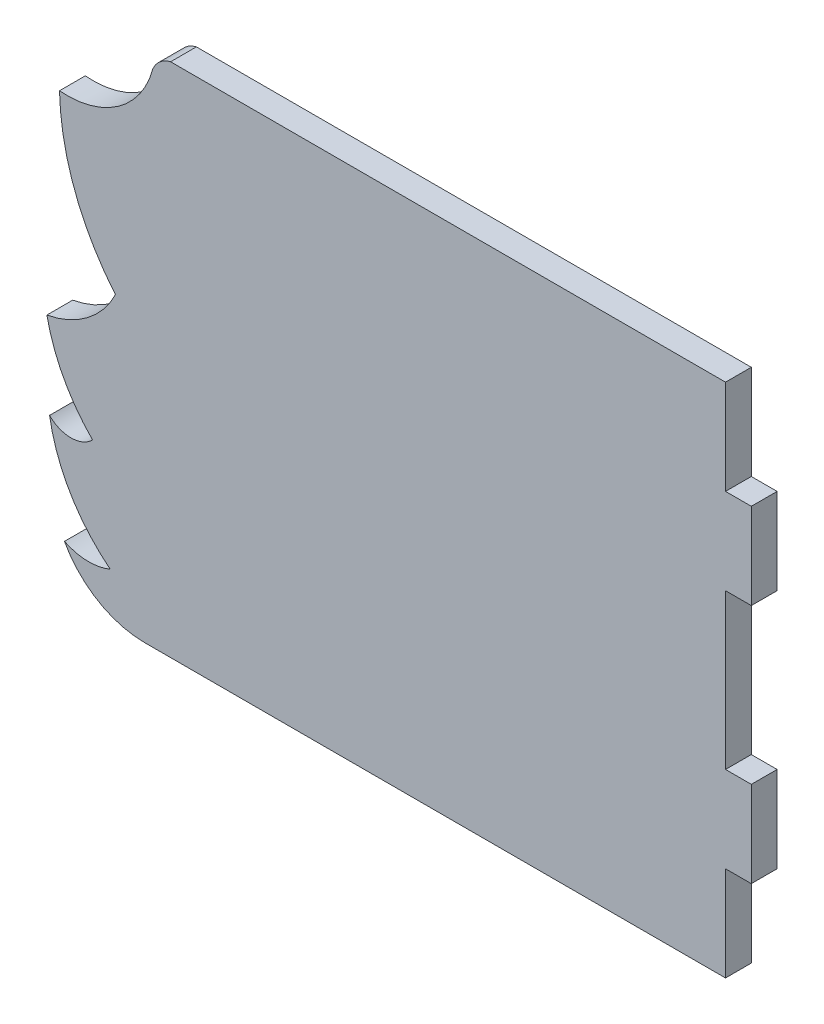
ISO-10303-21;
HEADER;
FILE_DESCRIPTION(('STEP AP214'),'2;1');
FILE_NAME('part.step','',(''),(''),'','','');
FILE_SCHEMA(('AUTOMOTIVE_DESIGN { 1 0 10303 214 1 1 1 1 }'));
ENDSEC;
DATA;
#1=APPLICATION_CONTEXT('core data for automotive mechanical design processes');
#2=APPLICATION_PROTOCOL_DEFINITION('international standard','automotive_design',2000,#1);
#3=PRODUCT_CONTEXT('',#1,'mechanical');
#4=PRODUCT('Part','Part','',(#3));
#5=PRODUCT_RELATED_PRODUCT_CATEGORY('part','',(#4));
#6=PRODUCT_DEFINITION_FORMATION('','',#4);
#7=PRODUCT_DEFINITION_CONTEXT('part definition',#1,'design');
#8=PRODUCT_DEFINITION('design','',#6,#7);
#9=PRODUCT_DEFINITION_SHAPE('','',#8);
#10=(LENGTH_UNIT() NAMED_UNIT(*) SI_UNIT(.MILLI.,.METRE.));
#11=(NAMED_UNIT(*) PLANE_ANGLE_UNIT() SI_UNIT($,.RADIAN.));
#12=(NAMED_UNIT(*) SI_UNIT($,.STERADIAN.) SOLID_ANGLE_UNIT());
#13=UNCERTAINTY_MEASURE_WITH_UNIT(LENGTH_MEASURE(1.E-05),#10,'distance_accuracy_value','');
#14=(GEOMETRIC_REPRESENTATION_CONTEXT(3) GLOBAL_UNCERTAINTY_ASSIGNED_CONTEXT((#13)) GLOBAL_UNIT_ASSIGNED_CONTEXT((#10,
#11,#12)) REPRESENTATION_CONTEXT('',''));
#15=CARTESIAN_POINT('',(0.,0.,0.));
#16=DIRECTION('',(0.,0.,1.));
#17=DIRECTION('',(1.,0.,0.));
#18=AXIS2_PLACEMENT_3D('',#15,#16,#17);
#19=CARTESIAN_POINT('',(29.9607071175536,44.0986460398184,3.));
#20=DIRECTION('',(0.,0.,-1.));
#21=DIRECTION('',(-1.,0.,0.));
#22=AXIS2_PLACEMENT_3D('',#19,#20,#21);
#23=CYLINDRICAL_SURFACE('',#22,2.99999999995477);
#24=CARTESIAN_POINT('',(29.9607071175536,44.0986460398184,0.));
#25=DIRECTION('',(0.,0.,1.));
#26=DIRECTION('',(1.,0.,0.));
#27=AXIS2_PLACEMENT_3D('',#24,#25,#26);
#28=CIRCLE('',#27,2.99999999995477);
#29=CARTESIAN_POINT('',(29.2607219478834,47.0158400275351,0.));
#30=VERTEX_POINT('',#29);
#31=CARTESIAN_POINT('',(27.1935295568562,45.2574075973882,0.));
#32=VERTEX_POINT('',#31);
#33=EDGE_CURVE('E201',#30,#32,#28,.T.);
#34=ORIENTED_EDGE('',*,*,#33,.T.);
#35=DIRECTION('',(0.,0.,-1.));
#36=VECTOR('',#35,1.);
#37=CARTESIAN_POINT('',(27.1935295568562,45.2574075973882,3.));
#38=LINE('',#37,#36);
#39=CARTESIAN_POINT('',(27.1935295568562,45.2574075973882,3.));
#40=VERTEX_POINT('',#39);
#41=EDGE_CURVE('E11',#40,#32,#38,.T.);
#42=ORIENTED_EDGE('',*,*,#41,.F.);
#43=CARTESIAN_POINT('',(29.9607071175536,44.0986460398184,3.));
#44=DIRECTION('',(0.,0.,1.));
#45=DIRECTION('',(1.,0.,0.));
#46=AXIS2_PLACEMENT_3D('',#43,#44,#45);
#47=CIRCLE('',#46,2.99999999995477);
#48=CARTESIAN_POINT('',(29.2607219478834,47.0158400275351,3.));
#49=VERTEX_POINT('',#48);
#50=EDGE_CURVE('E241',#49,#40,#47,.T.);
#51=ORIENTED_EDGE('',*,*,#50,.F.);
#52=DIRECTION('',(0.,0.,-1.));
#53=VECTOR('',#52,1.);
#54=CARTESIAN_POINT('',(29.2607219478834,47.0158400275351,3.));
#55=LINE('',#54,#53);
#56=EDGE_CURVE('E197',#49,#30,#55,.T.);
#57=ORIENTED_EDGE('',*,*,#56,.T.);
#58=EDGE_LOOP('',(#34,#42,#51,#57));
#59=FACE_BOUND('',#58,.T.);
#60=ADVANCED_FACE('F32',(#59),#23,.T.);
#61=CARTESIAN_POINT('',(17.2323642264028,47.9079142017122,3.));
#62=DIRECTION('',(0.,0.,-1.));
#63=DIRECTION('',(-1.,0.,0.));
#64=AXIS2_PLACEMENT_3D('',#61,#62,#63);
#65=CYLINDRICAL_SURFACE('',#64,10.3077640640535);
#66=CARTESIAN_POINT('',(17.2323642264028,47.9079142017122,0.));
#67=DIRECTION('',(0.,0.,-1.));
#68=DIRECTION('',(1.,0.,0.));
#69=AXIS2_PLACEMENT_3D('',#66,#67,#68);
#70=CIRCLE('',#69,10.3077640640535);
#71=CARTESIAN_POINT('',(16.3428186503063,37.6386051369192,0.));
#72=VERTEX_POINT('',#71);
#73=EDGE_CURVE('E204',#32,#72,#70,.T.);
#74=ORIENTED_EDGE('',*,*,#73,.T.);
#75=DIRECTION('',(0.,0.,-1.));
#76=VECTOR('',#75,1.);
#77=CARTESIAN_POINT('',(16.3428186503063,37.6386051369192,3.));
#78=LINE('',#77,#76);
#79=CARTESIAN_POINT('',(16.3428186503063,37.6386051369192,3.));
#80=VERTEX_POINT('',#79);
#81=EDGE_CURVE('E40',#80,#72,#78,.T.);
#82=ORIENTED_EDGE('',*,*,#81,.F.);
#83=CARTESIAN_POINT('',(17.2323642264028,47.9079142017122,3.));
#84=DIRECTION('',(0.,0.,-1.));
#85=DIRECTION('',(1.,0.,0.));
#86=AXIS2_PLACEMENT_3D('',#83,#84,#85);
#87=CIRCLE('',#86,10.3077640640535);
#88=EDGE_CURVE('E125',#40,#80,#87,.T.);
#89=ORIENTED_EDGE('',*,*,#88,.F.);
#90=ORIENTED_EDGE('',*,*,#41,.T.);
#91=EDGE_LOOP('',(#74,#82,#89,#90));
#92=FACE_BOUND('',#91,.T.);
#93=ADVANCED_FACE('F349',(#92),#65,.F.);
#94=CARTESIAN_POINT('',(44.2662174709285,38.2887491212369,3.));
#95=DIRECTION('',(0.,0.,-1.));
#96=DIRECTION('',(-1.,0.,0.));
#97=AXIS2_PLACEMENT_3D('',#94,#95,#96);
#98=CYLINDRICAL_SURFACE('',#97,27.9309664869634);
#99=CARTESIAN_POINT('',(44.2662174709285,38.2887491212369,0.));
#100=DIRECTION('',(0.,0.,1.));
#101=DIRECTION('',(1.,0.,0.));
#102=AXIS2_PLACEMENT_3D('',#99,#100,#101);
#103=CIRCLE('',#102,27.9309664869634);
#104=CARTESIAN_POINT('',(22.8505982508884,20.3580452221112,0.));
#105=VERTEX_POINT('',#104);
#106=EDGE_CURVE('E206',#72,#105,#103,.T.);
#107=ORIENTED_EDGE('',*,*,#106,.T.);
#108=DIRECTION('',(0.,0.,-1.));
#109=VECTOR('',#108,1.);
#110=CARTESIAN_POINT('',(22.8505982508884,20.3580452221112,3.));
#111=LINE('',#110,#109);
#112=CARTESIAN_POINT('',(22.8505982508884,20.3580452221112,3.));
#113=VERTEX_POINT('',#112);
#114=EDGE_CURVE('E284',#113,#105,#111,.T.);
#115=ORIENTED_EDGE('',*,*,#114,.F.);
#116=CARTESIAN_POINT('',(44.2662174709285,38.2887491212369,3.));
#117=DIRECTION('',(0.,0.,1.));
#118=DIRECTION('',(1.,0.,0.));
#119=AXIS2_PLACEMENT_3D('',#116,#117,#118);
#120=CIRCLE('',#119,27.9309664869634);
#121=EDGE_CURVE('E292',#80,#113,#120,.T.);
#122=ORIENTED_EDGE('',*,*,#121,.F.);
#123=ORIENTED_EDGE('',*,*,#81,.T.);
#124=EDGE_LOOP('',(#107,#115,#122,#123));
#125=FACE_BOUND('',#124,.T.);
#126=ADVANCED_FACE('F290',(#125),#98,.T.);
#127=CARTESIAN_POINT('',(12.8276506782866,25.3118843349796,3.));
#128=DIRECTION('',(0.,0.,-1.));
#129=DIRECTION('',(-1.,0.,0.));
#130=AXIS2_PLACEMENT_3D('',#127,#128,#129);
#131=CYLINDRICAL_SURFACE('',#130,11.1803398874681);
#132=CARTESIAN_POINT('',(12.8276506782866,25.3118843349796,0.));
#133=DIRECTION('',(0.,0.,-1.));
#134=DIRECTION('',(1.,0.,0.));
#135=AXIS2_PLACEMENT_3D('',#132,#133,#134);
#136=CIRCLE('',#135,11.1803398874681);
#137=CARTESIAN_POINT('',(14.8783479315641,14.3212228091792,0.));
#138=VERTEX_POINT('',#137);
#139=EDGE_CURVE('E208',#105,#138,#136,.T.);
#140=ORIENTED_EDGE('',*,*,#139,.T.);
#141=DIRECTION('',(0.,0.,-1.));
#142=VECTOR('',#141,1.);
#143=CARTESIAN_POINT('',(14.8783479315641,14.3212228091792,3.));
#144=LINE('',#143,#142);
#145=CARTESIAN_POINT('',(14.8783479315641,14.3212228091792,3.));
#146=VERTEX_POINT('',#145);
#147=EDGE_CURVE('E281',#146,#138,#144,.T.);
#148=ORIENTED_EDGE('',*,*,#147,.F.);
#149=CARTESIAN_POINT('',(12.8276506782866,25.3118843349796,3.));
#150=DIRECTION('',(0.,0.,-1.));
#151=DIRECTION('',(1.,0.,0.));
#152=AXIS2_PLACEMENT_3D('',#149,#150,#151);
#153=CIRCLE('',#152,11.1803398874681);
#154=EDGE_CURVE('E308',#113,#146,#153,.T.);
#155=ORIENTED_EDGE('',*,*,#154,.F.);
#156=ORIENTED_EDGE('',*,*,#114,.T.);
#157=EDGE_LOOP('',(#140,#148,#155,#156));
#158=FACE_BOUND('',#157,.T.);
#159=ADVANCED_FACE('F299',(#158),#131,.F.);
#160=CARTESIAN_POINT('',(34.2729714832764,18.3137676153475,3.));
#161=DIRECTION('',(0.,0.,-1.));
#162=DIRECTION('',(-1.,0.,0.));
#163=AXIS2_PLACEMENT_3D('',#160,#161,#162);
#164=CYLINDRICAL_SURFACE('',#163,19.8013089653663);
#165=CARTESIAN_POINT('',(34.2729714832764,18.3137676153475,0.));
#166=DIRECTION('',(0.,0.,1.));
#167=DIRECTION('',(1.,0.,0.));
#168=AXIS2_PLACEMENT_3D('',#165,#166,#167);
#169=CIRCLE('',#168,19.8013089653663);
#170=CARTESIAN_POINT('',(20.1882863024332,4.39566860368527,0.));
#171=VERTEX_POINT('',#170);
#172=EDGE_CURVE('E210',#138,#171,#169,.T.);
#173=ORIENTED_EDGE('',*,*,#172,.T.);
#174=DIRECTION('',(0.,0.,-1.));
#175=VECTOR('',#174,1.);
#176=CARTESIAN_POINT('',(20.1882863024332,4.39566860368527,3.));
#177=LINE('',#176,#175);
#178=CARTESIAN_POINT('',(20.1882863024332,4.39566860368527,3.));
#179=VERTEX_POINT('',#178);
#180=EDGE_CURVE('E278',#179,#171,#177,.T.);
#181=ORIENTED_EDGE('',*,*,#180,.F.);
#182=CARTESIAN_POINT('',(34.2729714832764,18.3137676153475,3.));
#183=DIRECTION('',(0.,0.,1.));
#184=DIRECTION('',(1.,0.,0.));
#185=AXIS2_PLACEMENT_3D('',#182,#183,#184);
#186=CIRCLE('',#185,19.8013089653663);
#187=EDGE_CURVE('E305',#146,#179,#186,.T.);
#188=ORIENTED_EDGE('',*,*,#187,.F.);
#189=ORIENTED_EDGE('',*,*,#147,.T.);
#190=EDGE_LOOP('',(#173,#181,#188,#189));
#191=FACE_BOUND('',#190,.T.);
#192=ADVANCED_FACE('F303',(#191),#164,.T.);
#193=CARTESIAN_POINT('',(17.6767859418686,6.88411509482363,3.));
#194=DIRECTION('',(0.,0.,-1.));
#195=DIRECTION('',(-1.,0.,0.));
#196=AXIS2_PLACEMENT_3D('',#193,#194,#195);
#197=CYLINDRICAL_SURFACE('',#196,3.53553390598575);
#198=CARTESIAN_POINT('',(17.6767859418686,6.88411509482363,0.));
#199=DIRECTION('',(0.,0.,-1.));
#200=DIRECTION('',(1.,0.,0.));
#201=AXIS2_PLACEMENT_3D('',#198,#199,#200);
#202=CIRCLE('',#201,3.53553390598575);
#203=CARTESIAN_POINT('',(15.1883394507301,4.37261473425916,0.));
#204=VERTEX_POINT('',#203);
#205=EDGE_CURVE('E212',#171,#204,#202,.T.);
#206=ORIENTED_EDGE('',*,*,#205,.T.);
#207=DIRECTION('',(0.,0.,-1.));
#208=VECTOR('',#207,1.);
#209=CARTESIAN_POINT('',(15.1883394507301,4.37261473425916,3.));
#210=LINE('',#209,#208);
#211=CARTESIAN_POINT('',(15.1883394507301,4.37261473425916,3.));
#212=VERTEX_POINT('',#211);
#213=EDGE_CURVE('E275',#212,#204,#210,.T.);
#214=ORIENTED_EDGE('',*,*,#213,.F.);
#215=CARTESIAN_POINT('',(17.6767859418686,6.88411509482363,3.));
#216=DIRECTION('',(0.,0.,-1.));
#217=DIRECTION('',(1.,0.,0.));
#218=AXIS2_PLACEMENT_3D('',#215,#216,#217);
#219=CIRCLE('',#218,3.53553390598575);
#220=EDGE_CURVE('E307',#179,#212,#219,.T.);
#221=ORIENTED_EDGE('',*,*,#220,.F.);
#222=ORIENTED_EDGE('',*,*,#180,.T.);
#223=EDGE_LOOP('',(#206,#214,#221,#222));
#224=FACE_BOUND('',#223,.T.);
#225=ADVANCED_FACE('F361',(#224),#197,.F.);
#226=CARTESIAN_POINT('',(34.2738430249036,7.56064756348411,3.));
#227=DIRECTION('',(0.,0.,-1.));
#228=DIRECTION('',(-1.,0.,0.));
#229=AXIS2_PLACEMENT_3D('',#226,#227,#228);
#230=CYLINDRICAL_SURFACE('',#229,19.3499354004091);
#231=CARTESIAN_POINT('',(34.2738430249036,7.56064756348411,0.));
#232=DIRECTION('',(0.,0.,1.));
#233=DIRECTION('',(1.,0.,0.));
#234=AXIS2_PLACEMENT_3D('',#231,#232,#233);
#235=CIRCLE('',#234,19.3499354004091);
#236=CARTESIAN_POINT('',(22.2435943296561,-7.59498229246384,0.));
#237=VERTEX_POINT('',#236);
#238=EDGE_CURVE('E214',#204,#237,#235,.T.);
#239=ORIENTED_EDGE('',*,*,#238,.T.);
#240=DIRECTION('',(0.,0.,-1.));
#241=VECTOR('',#240,1.);
#242=CARTESIAN_POINT('',(22.2435943296561,-7.59498229246384,3.));
#243=LINE('',#242,#241);
#244=CARTESIAN_POINT('',(22.2435943296561,-7.59498229246384,3.));
#245=VERTEX_POINT('',#244);
#246=EDGE_CURVE('E272',#245,#237,#243,.T.);
#247=ORIENTED_EDGE('',*,*,#246,.F.);
#248=CARTESIAN_POINT('',(34.2738430249036,7.56064756348411,3.));
#249=DIRECTION('',(0.,0.,1.));
#250=DIRECTION('',(1.,0.,0.));
#251=AXIS2_PLACEMENT_3D('',#248,#249,#250);
#252=CIRCLE('',#251,19.3499354004091);
#253=EDGE_CURVE('E310',#212,#245,#252,.T.);
#254=ORIENTED_EDGE('',*,*,#253,.F.);
#255=ORIENTED_EDGE('',*,*,#213,.T.);
#256=EDGE_LOOP('',(#239,#247,#254,#255));
#257=FACE_BOUND('',#256,.T.);
#258=ADVANCED_FACE('F364',(#257),#230,.T.);
#259=CARTESIAN_POINT('',(19.7465319808225,-1.57296604989448,3.));
#260=DIRECTION('',(0.,0.,-1.));
#261=DIRECTION('',(-1.,0.,0.));
#262=AXIS2_PLACEMENT_3D('',#259,#260,#261);
#263=CYLINDRICAL_SURFACE('',#262,6.51920240518207);
#264=CARTESIAN_POINT('',(19.7465319808225,-1.57296604989448,0.));
#265=DIRECTION('',(0.,0.,-1.));
#266=DIRECTION('',(1.,0.,0.));
#267=AXIS2_PLACEMENT_3D('',#264,#265,#266);
#268=CIRCLE('',#267,6.51920240518207);
#269=CARTESIAN_POINT('',(16.9208516162841,-7.44795800539484,0.));
#270=VERTEX_POINT('',#269);
#271=EDGE_CURVE('E216',#237,#270,#268,.T.);
#272=ORIENTED_EDGE('',*,*,#271,.T.);
#273=DIRECTION('',(0.,0.,-1.));
#274=VECTOR('',#273,1.);
#275=CARTESIAN_POINT('',(16.9208516162841,-7.44795800539484,3.));
#276=LINE('',#275,#274);
#277=CARTESIAN_POINT('',(16.9208516162841,-7.44795800539484,3.));
#278=VERTEX_POINT('',#277);
#279=EDGE_CURVE('E269',#278,#270,#276,.T.);
#280=ORIENTED_EDGE('',*,*,#279,.F.);
#281=CARTESIAN_POINT('',(19.7465319808225,-1.57296604989448,3.));
#282=DIRECTION('',(0.,0.,-1.));
#283=DIRECTION('',(1.,0.,0.));
#284=AXIS2_PLACEMENT_3D('',#281,#282,#283);
#285=CIRCLE('',#284,6.51920240518207);
#286=EDGE_CURVE('E316',#245,#278,#285,.T.);
#287=ORIENTED_EDGE('',*,*,#286,.F.);
#288=ORIENTED_EDGE('',*,*,#246,.T.);
#289=EDGE_LOOP('',(#272,#280,#287,#288));
#290=FACE_BOUND('',#289,.T.);
#291=ADVANCED_FACE('F368',(#290),#263,.F.);
#292=CARTESIAN_POINT('',(26.2596382031153,-2.33945565512156,3.));
#293=DIRECTION('',(0.,0.,-1.));
#294=DIRECTION('',(-1.,0.,0.));
#295=AXIS2_PLACEMENT_3D('',#292,#293,#294);
#296=CYLINDRICAL_SURFACE('',#295,10.6447043724626);
#297=CARTESIAN_POINT('',(26.2596382031153,-2.33945565512156,0.));
#298=DIRECTION('',(0.,0.,1.));
#299=DIRECTION('',(1.,0.,0.));
#300=AXIS2_PLACEMENT_3D('',#297,#298,#299);
#301=CIRCLE('',#300,10.6447043724626);
#302=CARTESIAN_POINT('',(26.2607219479043,-12.9841599724158,0.));
#303=VERTEX_POINT('',#302);
#304=EDGE_CURVE('E218',#270,#303,#301,.T.);
#305=ORIENTED_EDGE('',*,*,#304,.T.);
#306=DIRECTION('',(0.,0.,-1.));
#307=VECTOR('',#306,1.);
#308=CARTESIAN_POINT('',(26.2607219479043,-12.9841599724158,3.));
#309=LINE('',#308,#307);
#310=CARTESIAN_POINT('',(26.2607219479043,-12.9841599724158,3.));
#311=VERTEX_POINT('',#310);
#312=EDGE_CURVE('E266',#311,#303,#309,.T.);
#313=ORIENTED_EDGE('',*,*,#312,.F.);
#314=CARTESIAN_POINT('',(26.2596382031153,-2.33945565512156,3.));
#315=DIRECTION('',(0.,0.,1.));
#316=DIRECTION('',(1.,0.,0.));
#317=AXIS2_PLACEMENT_3D('',#314,#315,#316);
#318=CIRCLE('',#317,10.6447043724626);
#319=EDGE_CURVE('E318',#278,#311,#318,.T.);
#320=ORIENTED_EDGE('',*,*,#319,.F.);
#321=ORIENTED_EDGE('',*,*,#279,.T.);
#322=EDGE_LOOP('',(#305,#313,#320,#321));
#323=FACE_BOUND('',#322,.T.);
#324=ADVANCED_FACE('F372',(#323),#296,.T.);
#325=CARTESIAN_POINT('',(36.4111486897992,-12.9841599724158,3.));
#326=DIRECTION('',(0.,1.,0.));
#327=DIRECTION('',(0.,0.,1.));
#328=AXIS2_PLACEMENT_3D('',#325,#326,#327);
#329=PLANE('',#328);
#330=DIRECTION('',(1.,0.,0.));
#331=VECTOR('',#330,1.);
#332=CARTESIAN_POINT('',(36.4111486897992,-12.9841599724158,0.));
#333=LINE('',#332,#331);
#334=CARTESIAN_POINT('',(93.7857970087531,-12.9841599724158,0.));
#335=VERTEX_POINT('',#334);
#336=EDGE_CURVE('E221',#303,#335,#333,.T.);
#337=ORIENTED_EDGE('',*,*,#336,.T.);
#338=DIRECTION('',(0.,0.,-1.));
#339=VECTOR('',#338,1.);
#340=CARTESIAN_POINT('',(93.7857970087531,-12.9841599724158,3.));
#341=LINE('',#340,#339);
#342=CARTESIAN_POINT('',(93.7857970087531,-12.9841599724158,3.));
#343=VERTEX_POINT('',#342);
#344=EDGE_CURVE('E263',#343,#335,#341,.T.);
#345=ORIENTED_EDGE('',*,*,#344,.F.);
#346=DIRECTION('',(1.,0.,0.));
#347=VECTOR('',#346,1.);
#348=CARTESIAN_POINT('',(26.2607219479043,-12.9841599724158,3.));
#349=LINE('',#348,#347);
#350=EDGE_CURVE('E320',#311,#343,#349,.T.);
#351=ORIENTED_EDGE('',*,*,#350,.F.);
#352=ORIENTED_EDGE('',*,*,#312,.T.);
#353=EDGE_LOOP('',(#337,#345,#351,#352));
#354=FACE_BOUND('',#353,.T.);
#355=ADVANCED_FACE('F376',(#354),#329,.F.);
#356=CARTESIAN_POINT('',(93.7857970087531,-12.9841599724158,3.));
#357=DIRECTION('',(-1.,0.,0.));
#358=DIRECTION('',(0.,0.,1.));
#359=AXIS2_PLACEMENT_3D('',#356,#357,#358);
#360=PLANE('',#359);
#361=DIRECTION('',(0.,1.,0.));
#362=VECTOR('',#361,1.);
#363=CARTESIAN_POINT('',(93.7857970087531,-12.9841599724158,0.));
#364=LINE('',#363,#362);
#365=CARTESIAN_POINT('',(93.7857970087531,-1.98415997241584,0.));
#366=VERTEX_POINT('',#365);
#367=EDGE_CURVE('E223',#335,#366,#364,.T.);
#368=ORIENTED_EDGE('',*,*,#367,.T.);
#369=DIRECTION('',(0.,0.,-1.));
#370=VECTOR('',#369,1.);
#371=CARTESIAN_POINT('',(93.7857970087531,-1.98415997241584,3.));
#372=LINE('',#371,#370);
#373=CARTESIAN_POINT('',(93.7857970087531,-1.98415997241584,3.));
#374=VERTEX_POINT('',#373);
#375=EDGE_CURVE('E260',#374,#366,#372,.T.);
#376=ORIENTED_EDGE('',*,*,#375,.F.);
#377=DIRECTION('',(0.,1.,0.));
#378=VECTOR('',#377,1.);
#379=CARTESIAN_POINT('',(93.7857970087531,-12.9841599724158,3.));
#380=LINE('',#379,#378);
#381=EDGE_CURVE('E322',#343,#374,#380,.T.);
#382=ORIENTED_EDGE('',*,*,#381,.F.);
#383=ORIENTED_EDGE('',*,*,#344,.T.);
#384=EDGE_LOOP('',(#368,#376,#382,#383));
#385=FACE_BOUND('',#384,.T.);
#386=ADVANCED_FACE('F380',(#385),#360,.F.);
#387=CARTESIAN_POINT('',(93.7857970087531,-1.98415997241584,3.));
#388=DIRECTION('',(0.,1.,0.));
#389=DIRECTION('',(0.,0.,1.));
#390=AXIS2_PLACEMENT_3D('',#387,#388,#389);
#391=PLANE('',#390);
#392=DIRECTION('',(1.,0.,0.));
#393=VECTOR('',#392,1.);
#394=CARTESIAN_POINT('',(93.7857970087531,-1.98415997241584,0.));
#395=LINE('',#394,#393);
#396=CARTESIAN_POINT('',(96.7857970087531,-1.98415997241584,0.));
#397=VERTEX_POINT('',#396);
#398=EDGE_CURVE('E225',#366,#397,#395,.T.);
#399=ORIENTED_EDGE('',*,*,#398,.T.);
#400=DIRECTION('',(0.,0.,-1.));
#401=VECTOR('',#400,1.);
#402=CARTESIAN_POINT('',(96.7857970087531,-1.98415997241584,3.));
#403=LINE('',#402,#401);
#404=CARTESIAN_POINT('',(96.7857970087531,-1.98415997241584,3.));
#405=VERTEX_POINT('',#404);
#406=EDGE_CURVE('E257',#405,#397,#403,.T.);
#407=ORIENTED_EDGE('',*,*,#406,.F.);
#408=DIRECTION('',(1.,0.,0.));
#409=VECTOR('',#408,1.);
#410=CARTESIAN_POINT('',(93.7857970087531,-1.98415997241584,3.));
#411=LINE('',#410,#409);
#412=EDGE_CURVE('E324',#374,#405,#411,.T.);
#413=ORIENTED_EDGE('',*,*,#412,.F.);
#414=ORIENTED_EDGE('',*,*,#375,.T.);
#415=EDGE_LOOP('',(#399,#407,#413,#414));
#416=FACE_BOUND('',#415,.T.);
#417=ADVANCED_FACE('F384',(#416),#391,.F.);
#418=CARTESIAN_POINT('',(96.7857970087531,8.01584002758416,3.));
#419=DIRECTION('',(-1.,0.,0.));
#420=DIRECTION('',(0.,0.,1.));
#421=AXIS2_PLACEMENT_3D('',#418,#419,#420);
#422=PLANE('',#421);
#423=DIRECTION('',(0.,1.,0.));
#424=VECTOR('',#423,1.);
#425=CARTESIAN_POINT('',(96.7857970087531,8.01584002758416,0.));
#426=LINE('',#425,#424);
#427=CARTESIAN_POINT('',(96.7857970087531,8.01584002758416,0.));
#428=VERTEX_POINT('',#427);
#429=EDGE_CURVE('E227',#397,#428,#426,.T.);
#430=ORIENTED_EDGE('',*,*,#429,.T.);
#431=DIRECTION('',(0.,0.,-1.));
#432=VECTOR('',#431,1.);
#433=CARTESIAN_POINT('',(96.7857970087531,8.01584002758416,3.));
#434=LINE('',#433,#432);
#435=CARTESIAN_POINT('',(96.7857970087531,8.01584002758416,3.));
#436=VERTEX_POINT('',#435);
#437=EDGE_CURVE('E254',#436,#428,#434,.T.);
#438=ORIENTED_EDGE('',*,*,#437,.F.);
#439=DIRECTION('',(0.,1.,0.));
#440=VECTOR('',#439,1.);
#441=CARTESIAN_POINT('',(96.7857970087531,8.01584002758416,3.));
#442=LINE('',#441,#440);
#443=EDGE_CURVE('E326',#405,#436,#442,.T.);
#444=ORIENTED_EDGE('',*,*,#443,.F.);
#445=ORIENTED_EDGE('',*,*,#406,.T.);
#446=EDGE_LOOP('',(#430,#438,#444,#445));
#447=FACE_BOUND('',#446,.T.);
#448=ADVANCED_FACE('F388',(#447),#422,.F.);
#449=CARTESIAN_POINT('',(96.7857970087531,8.01584002758416,3.));
#450=DIRECTION('',(0.,-1.,0.));
#451=DIRECTION('',(0.,0.,-1.));
#452=AXIS2_PLACEMENT_3D('',#449,#450,#451);
#453=PLANE('',#452);
#454=DIRECTION('',(-1.,0.,0.));
#455=VECTOR('',#454,1.);
#456=CARTESIAN_POINT('',(96.7857970087531,8.01584002758416,0.));
#457=LINE('',#456,#455);
#458=CARTESIAN_POINT('',(93.7857970087531,8.01584002758416,0.));
#459=VERTEX_POINT('',#458);
#460=EDGE_CURVE('E229',#428,#459,#457,.T.);
#461=ORIENTED_EDGE('',*,*,#460,.T.);
#462=DIRECTION('',(0.,0.,-1.));
#463=VECTOR('',#462,1.);
#464=CARTESIAN_POINT('',(93.7857970087531,8.01584002758416,3.));
#465=LINE('',#464,#463);
#466=CARTESIAN_POINT('',(93.7857970087531,8.01584002758416,3.));
#467=VERTEX_POINT('',#466);
#468=EDGE_CURVE('E251',#467,#459,#465,.T.);
#469=ORIENTED_EDGE('',*,*,#468,.F.);
#470=DIRECTION('',(-1.,0.,0.));
#471=VECTOR('',#470,1.);
#472=CARTESIAN_POINT('',(96.7857970087531,8.01584002758416,3.));
#473=LINE('',#472,#471);
#474=EDGE_CURVE('E328',#436,#467,#473,.T.);
#475=ORIENTED_EDGE('',*,*,#474,.F.);
#476=ORIENTED_EDGE('',*,*,#437,.T.);
#477=EDGE_LOOP('',(#461,#469,#475,#476));
#478=FACE_BOUND('',#477,.T.);
#479=ADVANCED_FACE('F392',(#478),#453,.F.);
#480=CARTESIAN_POINT('',(93.7857970087531,8.01584002758416,3.));
#481=DIRECTION('',(-1.,0.,0.));
#482=DIRECTION('',(0.,0.,1.));
#483=AXIS2_PLACEMENT_3D('',#480,#481,#482);
#484=PLANE('',#483);
#485=DIRECTION('',(0.,1.,0.));
#486=VECTOR('',#485,1.);
#487=CARTESIAN_POINT('',(93.7857970087531,8.01584002758416,0.));
#488=LINE('',#487,#486);
#489=CARTESIAN_POINT('',(93.7857970087531,26.0158400275842,0.));
#490=VERTEX_POINT('',#489);
#491=EDGE_CURVE('E231',#459,#490,#488,.T.);
#492=ORIENTED_EDGE('',*,*,#491,.T.);
#493=DIRECTION('',(0.,0.,-1.));
#494=VECTOR('',#493,1.);
#495=CARTESIAN_POINT('',(93.7857970087531,26.0158400275842,3.));
#496=LINE('',#495,#494);
#497=CARTESIAN_POINT('',(93.7857970087531,26.0158400275842,3.));
#498=VERTEX_POINT('',#497);
#499=EDGE_CURVE('E248',#498,#490,#496,.T.);
#500=ORIENTED_EDGE('',*,*,#499,.F.);
#501=DIRECTION('',(0.,1.,0.));
#502=VECTOR('',#501,1.);
#503=CARTESIAN_POINT('',(93.7857970087531,8.01584002758416,3.));
#504=LINE('',#503,#502);
#505=EDGE_CURVE('E330',#467,#498,#504,.T.);
#506=ORIENTED_EDGE('',*,*,#505,.F.);
#507=ORIENTED_EDGE('',*,*,#468,.T.);
#508=EDGE_LOOP('',(#492,#500,#506,#507));
#509=FACE_BOUND('',#508,.T.);
#510=ADVANCED_FACE('F396',(#509),#484,.F.);
#511=CARTESIAN_POINT('',(93.7857970087531,26.0158400275842,3.));
#512=DIRECTION('',(0.,1.,0.));
#513=DIRECTION('',(0.,0.,1.));
#514=AXIS2_PLACEMENT_3D('',#511,#512,#513);
#515=PLANE('',#514);
#516=DIRECTION('',(1.,0.,0.));
#517=VECTOR('',#516,1.);
#518=CARTESIAN_POINT('',(93.7857970087531,26.0158400275842,0.));
#519=LINE('',#518,#517);
#520=CARTESIAN_POINT('',(96.7857970087531,26.0158400275842,0.));
#521=VERTEX_POINT('',#520);
#522=EDGE_CURVE('E233',#490,#521,#519,.T.);
#523=ORIENTED_EDGE('',*,*,#522,.T.);
#524=DIRECTION('',(0.,0.,-1.));
#525=VECTOR('',#524,1.);
#526=CARTESIAN_POINT('',(96.7857970087531,26.0158400275842,3.));
#527=LINE('',#526,#525);
#528=CARTESIAN_POINT('',(96.7857970087531,26.0158400275842,3.));
#529=VERTEX_POINT('',#528);
#530=EDGE_CURVE('E245',#529,#521,#527,.T.);
#531=ORIENTED_EDGE('',*,*,#530,.F.);
#532=DIRECTION('',(1.,0.,0.));
#533=VECTOR('',#532,1.);
#534=CARTESIAN_POINT('',(93.7857970087531,26.0158400275842,3.));
#535=LINE('',#534,#533);
#536=EDGE_CURVE('E332',#498,#529,#535,.T.);
#537=ORIENTED_EDGE('',*,*,#536,.F.);
#538=ORIENTED_EDGE('',*,*,#499,.T.);
#539=EDGE_LOOP('',(#523,#531,#537,#538));
#540=FACE_BOUND('',#539,.T.);
#541=ADVANCED_FACE('F338',(#540),#515,.F.);
#542=CARTESIAN_POINT('',(96.7857970087531,26.0158400275842,3.));
#543=DIRECTION('',(-1.,0.,0.));
#544=DIRECTION('',(0.,0.,1.));
#545=AXIS2_PLACEMENT_3D('',#542,#543,#544);
#546=PLANE('',#545);
#547=DIRECTION('',(0.,1.,0.));
#548=VECTOR('',#547,1.);
#549=CARTESIAN_POINT('',(96.7857970087531,26.0158400275842,0.));
#550=LINE('',#549,#548);
#551=CARTESIAN_POINT('',(96.7857970087531,36.0158400275842,0.));
#552=VERTEX_POINT('',#551);
#553=EDGE_CURVE('E235',#521,#552,#550,.T.);
#554=ORIENTED_EDGE('',*,*,#553,.T.);
#555=DIRECTION('',(0.,0.,-1.));
#556=VECTOR('',#555,1.);
#557=CARTESIAN_POINT('',(96.7857970087531,36.0158400275842,3.));
#558=LINE('',#557,#556);
#559=CARTESIAN_POINT('',(96.7857970087531,36.0158400275842,3.));
#560=VERTEX_POINT('',#559);
#561=EDGE_CURVE('E192',#560,#552,#558,.T.);
#562=ORIENTED_EDGE('',*,*,#561,.F.);
#563=DIRECTION('',(0.,1.,0.));
#564=VECTOR('',#563,1.);
#565=CARTESIAN_POINT('',(96.7857970087531,26.0158400275842,3.));
#566=LINE('',#565,#564);
#567=EDGE_CURVE('E181',#529,#560,#566,.T.);
#568=ORIENTED_EDGE('',*,*,#567,.F.);
#569=ORIENTED_EDGE('',*,*,#530,.T.);
#570=EDGE_LOOP('',(#554,#562,#568,#569));
#571=FACE_BOUND('',#570,.T.);
#572=ADVANCED_FACE('F342',(#571),#546,.F.);
#573=CARTESIAN_POINT('',(96.7857970087531,36.0158400275842,3.));
#574=DIRECTION('',(0.,-1.,0.));
#575=DIRECTION('',(0.,0.,-1.));
#576=AXIS2_PLACEMENT_3D('',#573,#574,#575);
#577=PLANE('',#576);
#578=DIRECTION('',(-1.,0.,0.));
#579=VECTOR('',#578,1.);
#580=CARTESIAN_POINT('',(96.7857970087531,36.0158400275842,0.));
#581=LINE('',#580,#579);
#582=CARTESIAN_POINT('',(93.7857970087531,36.0158400275842,0.));
#583=VERTEX_POINT('',#582);
#584=EDGE_CURVE('E190',#552,#583,#581,.T.);
#585=ORIENTED_EDGE('',*,*,#584,.T.);
#586=DIRECTION('',(0.,0.,-1.));
#587=VECTOR('',#586,1.);
#588=CARTESIAN_POINT('',(93.7857970087531,36.0158400275842,3.));
#589=LINE('',#588,#587);
#590=CARTESIAN_POINT('',(93.7857970087531,36.0158400275842,3.));
#591=VERTEX_POINT('',#590);
#592=EDGE_CURVE('E187',#591,#583,#589,.T.);
#593=ORIENTED_EDGE('',*,*,#592,.F.);
#594=DIRECTION('',(-1.,0.,0.));
#595=VECTOR('',#594,1.);
#596=CARTESIAN_POINT('',(96.7857970087531,36.0158400275842,3.));
#597=LINE('',#596,#595);
#598=EDGE_CURVE('E174',#560,#591,#597,.T.);
#599=ORIENTED_EDGE('',*,*,#598,.F.);
#600=ORIENTED_EDGE('',*,*,#561,.T.);
#601=EDGE_LOOP('',(#585,#593,#599,#600));
#602=FACE_BOUND('',#601,.T.);
#603=ADVANCED_FACE('F188',(#602),#577,.F.);
#604=CARTESIAN_POINT('',(93.7857970087531,36.0158400275842,3.));
#605=DIRECTION('',(-1.,0.,0.));
#606=DIRECTION('',(0.,0.,1.));
#607=AXIS2_PLACEMENT_3D('',#604,#605,#606);
#608=PLANE('',#607);
#609=DIRECTION('',(0.,1.,0.));
#610=VECTOR('',#609,1.);
#611=CARTESIAN_POINT('',(93.7857970087531,36.0158400275842,0.));
#612=LINE('',#611,#610);
#613=CARTESIAN_POINT('',(93.7857970087531,47.0158400275842,0.));
#614=VERTEX_POINT('',#613);
#615=EDGE_CURVE('E238',#583,#614,#612,.T.);
#616=ORIENTED_EDGE('',*,*,#615,.T.);
#617=DIRECTION('',(0.,0.,-1.));
#618=VECTOR('',#617,1.);
#619=CARTESIAN_POINT('',(93.7857970087531,47.0158400275842,3.));
#620=LINE('',#619,#618);
#621=CARTESIAN_POINT('',(93.7857970087531,47.0158400275842,3.));
#622=VERTEX_POINT('',#621);
#623=EDGE_CURVE('E193',#622,#614,#620,.T.);
#624=ORIENTED_EDGE('',*,*,#623,.F.);
#625=DIRECTION('',(0.,1.,0.));
#626=VECTOR('',#625,1.);
#627=CARTESIAN_POINT('',(93.7857970087531,36.0158400275842,3.));
#628=LINE('',#627,#626);
#629=EDGE_CURVE('E178',#591,#622,#628,.T.);
#630=ORIENTED_EDGE('',*,*,#629,.F.);
#631=ORIENTED_EDGE('',*,*,#592,.T.);
#632=EDGE_LOOP('',(#616,#624,#630,#631));
#633=FACE_BOUND('',#632,.T.);
#634=ADVANCED_FACE('F195',(#633),#608,.F.);
#635=CARTESIAN_POINT('',(31.7511789440031,47.0158400275374,3.));
#636=DIRECTION('',(9.25016083267677E-13,-1.,0.));
#637=DIRECTION('',(1.,9.25016083267677E-13,0.));
#638=AXIS2_PLACEMENT_3D('',#635,#636,#637);
#639=PLANE('',#638);
#640=DIRECTION('',(-1.,-9.25016083267677E-13,0.));
#641=VECTOR('',#640,1.);
#642=CARTESIAN_POINT('',(31.7511789440031,47.0158400275374,0.));
#643=LINE('',#642,#641);
#644=EDGE_CURVE('E113',#614,#30,#643,.T.);
#645=ORIENTED_EDGE('',*,*,#644,.T.);
#646=ORIENTED_EDGE('',*,*,#56,.F.);
#647=DIRECTION('',(-1.,-7.54575102354937E-13,0.));
#648=VECTOR('',#647,1.);
#649=CARTESIAN_POINT('',(93.7857970087531,47.0158400275842,3.));
#650=LINE('',#649,#648);
#651=EDGE_CURVE('E48',#622,#49,#650,.T.);
#652=ORIENTED_EDGE('',*,*,#651,.F.);
#653=ORIENTED_EDGE('',*,*,#623,.T.);
#654=EDGE_LOOP('',(#645,#646,#652,#653));
#655=FACE_BOUND('',#654,.T.);
#656=ADVANCED_FACE('F343',(#655),#639,.F.);
#657=CARTESIAN_POINT('',(29.9607071175536,44.0986460398184,3.));
#658=DIRECTION('',(0.,0.,1.));
#659=DIRECTION('',(1.,0.,0.));
#660=AXIS2_PLACEMENT_3D('',#657,#658,#659);
#661=PLANE('',#660);
#662=ORIENTED_EDGE('',*,*,#50,.T.);
#663=ORIENTED_EDGE('',*,*,#88,.T.);
#664=ORIENTED_EDGE('',*,*,#121,.T.);
#665=ORIENTED_EDGE('',*,*,#154,.T.);
#666=ORIENTED_EDGE('',*,*,#187,.T.);
#667=ORIENTED_EDGE('',*,*,#220,.T.);
#668=ORIENTED_EDGE('',*,*,#253,.T.);
#669=ORIENTED_EDGE('',*,*,#286,.T.);
#670=ORIENTED_EDGE('',*,*,#319,.T.);
#671=ORIENTED_EDGE('',*,*,#350,.T.);
#672=ORIENTED_EDGE('',*,*,#381,.T.);
#673=ORIENTED_EDGE('',*,*,#412,.T.);
#674=ORIENTED_EDGE('',*,*,#443,.T.);
#675=ORIENTED_EDGE('',*,*,#474,.T.);
#676=ORIENTED_EDGE('',*,*,#505,.T.);
#677=ORIENTED_EDGE('',*,*,#536,.T.);
#678=ORIENTED_EDGE('',*,*,#567,.T.);
#679=ORIENTED_EDGE('',*,*,#598,.T.);
#680=ORIENTED_EDGE('',*,*,#629,.T.);
#681=ORIENTED_EDGE('',*,*,#651,.T.);
#682=EDGE_LOOP('',(#662,#663,#664,#665,#666,#667,#668,#669,#670,#671,#672,#673,#674,#675,#676,
#677,#678,#679,#680,#681));
#683=FACE_BOUND('',#682,.T.);
#684=ADVANCED_FACE('F176',(#683),#661,.T.);
#685=CARTESIAN_POINT('',(29.9607071175536,44.0986460398184,0.));
#686=DIRECTION('',(0.,0.,1.));
#687=DIRECTION('',(1.,0.,0.));
#688=AXIS2_PLACEMENT_3D('',#685,#686,#687);
#689=PLANE('',#688);
#690=ORIENTED_EDGE('',*,*,#33,.F.);
#691=ORIENTED_EDGE('',*,*,#644,.F.);
#692=ORIENTED_EDGE('',*,*,#615,.F.);
#693=ORIENTED_EDGE('',*,*,#584,.F.);
#694=ORIENTED_EDGE('',*,*,#553,.F.);
#695=ORIENTED_EDGE('',*,*,#522,.F.);
#696=ORIENTED_EDGE('',*,*,#491,.F.);
#697=ORIENTED_EDGE('',*,*,#460,.F.);
#698=ORIENTED_EDGE('',*,*,#429,.F.);
#699=ORIENTED_EDGE('',*,*,#398,.F.);
#700=ORIENTED_EDGE('',*,*,#367,.F.);
#701=ORIENTED_EDGE('',*,*,#336,.F.);
#702=ORIENTED_EDGE('',*,*,#304,.F.);
#703=ORIENTED_EDGE('',*,*,#271,.F.);
#704=ORIENTED_EDGE('',*,*,#238,.F.);
#705=ORIENTED_EDGE('',*,*,#205,.F.);
#706=ORIENTED_EDGE('',*,*,#172,.F.);
#707=ORIENTED_EDGE('',*,*,#139,.F.);
#708=ORIENTED_EDGE('',*,*,#106,.F.);
#709=ORIENTED_EDGE('',*,*,#73,.F.);
#710=EDGE_LOOP('',(#690,#691,#692,#693,#694,#695,#696,#697,#698,#699,#700,#701,#702,#703,#704,
#705,#706,#707,#708,#709));
#711=FACE_BOUND('',#710,.T.);
#712=ADVANCED_FACE('F294',(#711),#689,.F.);
#713=CLOSED_SHELL('',(#60,#93,#126,#159,#192,#225,#258,#291,#324,#355,#386,#417,#448,#479,#510,
#541,#572,#603,#634,#656,#684,#712));
#714=MANIFOLD_SOLID_BREP('B2',#713);
#715=ADVANCED_BREP_SHAPE_REPRESENTATION('',(#18,#714),#14);
#716=SHAPE_DEFINITION_REPRESENTATION(#9,#715);
ENDSEC;
END-ISO-10303-21;
